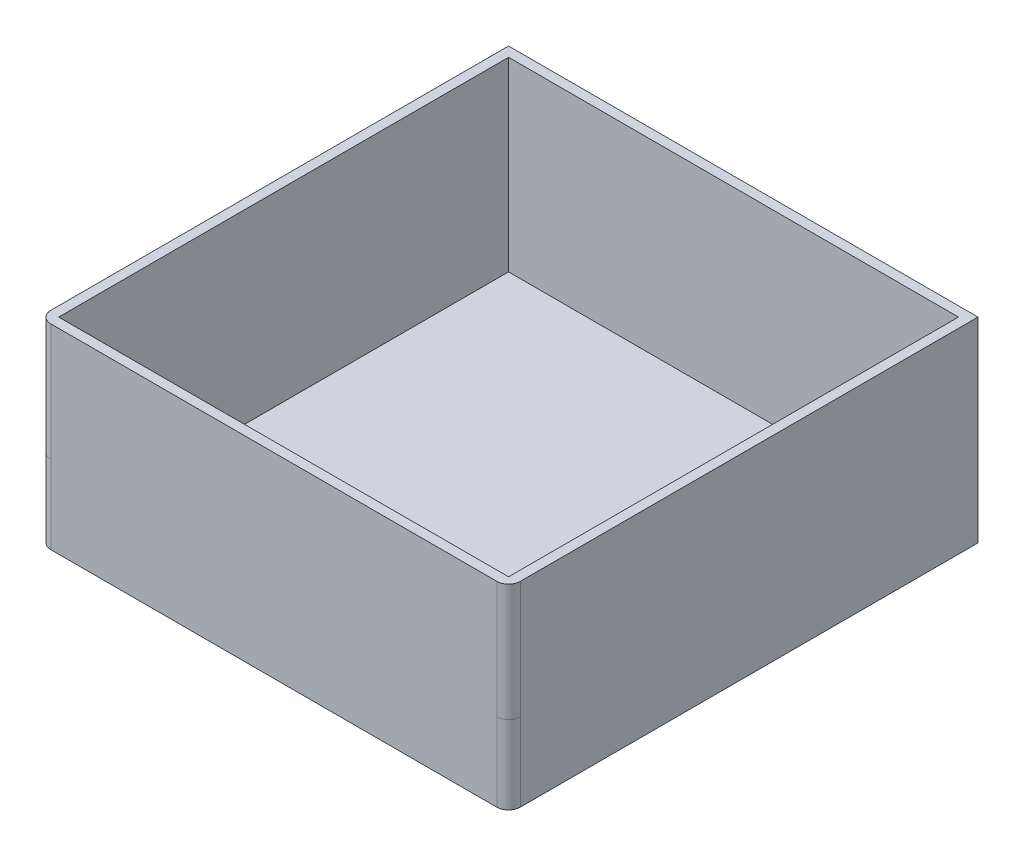
ISO-10303-21;
HEADER;
FILE_DESCRIPTION(('STEP AP214'),'2;1');
FILE_NAME('part.step','',(''),(''),'','','');
FILE_SCHEMA(('AUTOMOTIVE_DESIGN { 1 0 10303 214 1 1 1 1 }'));
ENDSEC;
DATA;
#1=APPLICATION_CONTEXT('core data for automotive mechanical design processes');
#2=APPLICATION_PROTOCOL_DEFINITION('international standard','automotive_design',2000,#1);
#3=PRODUCT_CONTEXT('',#1,'mechanical');
#4=PRODUCT('Part','Part','',(#3));
#5=PRODUCT_RELATED_PRODUCT_CATEGORY('part','',(#4));
#6=PRODUCT_DEFINITION_FORMATION('','',#4);
#7=PRODUCT_DEFINITION_CONTEXT('part definition',#1,'design');
#8=PRODUCT_DEFINITION('design','',#6,#7);
#9=PRODUCT_DEFINITION_SHAPE('','',#8);
#10=(LENGTH_UNIT() NAMED_UNIT(*) SI_UNIT(.MILLI.,.METRE.));
#11=(NAMED_UNIT(*) PLANE_ANGLE_UNIT() SI_UNIT($,.RADIAN.));
#12=(NAMED_UNIT(*) SI_UNIT($,.STERADIAN.) SOLID_ANGLE_UNIT());
#13=UNCERTAINTY_MEASURE_WITH_UNIT(LENGTH_MEASURE(1.E-05),#10,'distance_accuracy_value','');
#14=(GEOMETRIC_REPRESENTATION_CONTEXT(3) GLOBAL_UNCERTAINTY_ASSIGNED_CONTEXT((#13)) GLOBAL_UNIT_ASSIGNED_CONTEXT((#10,
#11,#12)) REPRESENTATION_CONTEXT('',''));
#15=CARTESIAN_POINT('',(0.,0.,0.));
#16=DIRECTION('',(0.,0.,1.));
#17=DIRECTION('',(1.,0.,0.));
#18=AXIS2_PLACEMENT_3D('',#15,#16,#17);
#19=CARTESIAN_POINT('',(0.,2.5,-2.5));
#20=DIRECTION('',(0.,0.,-1.));
#21=DIRECTION('',(-1.,0.,0.));
#22=AXIS2_PLACEMENT_3D('',#19,#20,#21);
#23=PLANE('',#22);
#24=DIRECTION('',(0.,1.,0.));
#25=VECTOR('',#24,1.);
#26=CARTESIAN_POINT('',(2.49999999999999,2.5,-2.5));
#27=LINE('',#26,#25);
#28=CARTESIAN_POINT('',(2.49999999999999,2.5,-2.5));
#29=VERTEX_POINT('',#28);
#30=CARTESIAN_POINT('',(2.49999999999999,50.,-2.5));
#31=VERTEX_POINT('',#30);
#32=EDGE_CURVE('E128',#29,#31,#27,.T.);
#33=ORIENTED_EDGE('',*,*,#32,.T.);
#34=DIRECTION('',(1.,0.,0.));
#35=VECTOR('',#34,1.);
#36=CARTESIAN_POINT('',(2.49999999999999,50.,-2.5));
#37=LINE('',#36,#35);
#38=CARTESIAN_POINT('',(117.5,50.,-2.5));
#39=VERTEX_POINT('',#38);
#40=EDGE_CURVE('E132',#31,#39,#37,.T.);
#41=ORIENTED_EDGE('',*,*,#40,.T.);
#42=DIRECTION('',(0.,1.,0.));
#43=VECTOR('',#42,1.);
#44=CARTESIAN_POINT('',(117.5,2.5,-2.5));
#45=LINE('',#44,#43);
#46=CARTESIAN_POINT('',(117.5,2.5,-2.5));
#47=VERTEX_POINT('',#46);
#48=EDGE_CURVE('E171',#47,#39,#45,.T.);
#49=ORIENTED_EDGE('',*,*,#48,.F.);
#50=DIRECTION('',(-1.,0.,0.));
#51=VECTOR('',#50,1.);
#52=CARTESIAN_POINT('',(0.,2.5,-2.5));
#53=LINE('',#52,#51);
#54=EDGE_CURVE('E135',#47,#29,#53,.T.);
#55=ORIENTED_EDGE('',*,*,#54,.T.);
#56=EDGE_LOOP('',(#33,#41,#49,#55));
#57=FACE_BOUND('',#56,.T.);
#58=ADVANCED_FACE('F35',(#57),#23,.T.);
#59=CARTESIAN_POINT('',(2.49999999999999,2.5,0.));
#60=DIRECTION('',(1.,0.,0.));
#61=DIRECTION('',(0.,0.,-1.));
#62=AXIS2_PLACEMENT_3D('',#59,#60,#61);
#63=PLANE('',#62);
#64=DIRECTION('',(0.,1.,0.));
#65=VECTOR('',#64,1.);
#66=CARTESIAN_POINT('',(2.49999999999999,2.5,-117.5));
#67=LINE('',#66,#65);
#68=CARTESIAN_POINT('',(2.49999999999999,2.5,-117.5));
#69=VERTEX_POINT('',#68);
#70=CARTESIAN_POINT('',(2.49999999999999,50.,-117.5));
#71=VERTEX_POINT('',#70);
#72=EDGE_CURVE('E138',#69,#71,#67,.T.);
#73=ORIENTED_EDGE('',*,*,#72,.T.);
#74=DIRECTION('',(0.,0.,1.));
#75=VECTOR('',#74,1.);
#76=CARTESIAN_POINT('',(2.49999999999999,50.,-117.5));
#77=LINE('',#76,#75);
#78=EDGE_CURVE('E141',#71,#31,#77,.T.);
#79=ORIENTED_EDGE('',*,*,#78,.T.);
#80=ORIENTED_EDGE('',*,*,#32,.F.);
#81=DIRECTION('',(0.,0.,-1.));
#82=VECTOR('',#81,1.);
#83=CARTESIAN_POINT('',(2.49999999999999,2.5,0.));
#84=LINE('',#83,#82);
#85=EDGE_CURVE('E170',#29,#69,#84,.T.);
#86=ORIENTED_EDGE('',*,*,#85,.T.);
#87=EDGE_LOOP('',(#73,#79,#80,#86));
#88=FACE_BOUND('',#87,.T.);
#89=ADVANCED_FACE('F142',(#88),#63,.T.);
#90=CARTESIAN_POINT('',(0.,2.5,-117.5));
#91=DIRECTION('',(0.,0.,1.));
#92=DIRECTION('',(1.,0.,0.));
#93=AXIS2_PLACEMENT_3D('',#90,#91,#92);
#94=PLANE('',#93);
#95=DIRECTION('',(0.,1.,0.));
#96=VECTOR('',#95,1.);
#97=CARTESIAN_POINT('',(117.5,2.5,-117.5));
#98=LINE('',#97,#96);
#99=CARTESIAN_POINT('',(117.5,2.5,-117.5));
#100=VERTEX_POINT('',#99);
#101=CARTESIAN_POINT('',(117.5,50.,-117.5));
#102=VERTEX_POINT('',#101);
#103=EDGE_CURVE('E174',#100,#102,#98,.T.);
#104=ORIENTED_EDGE('',*,*,#103,.T.);
#105=DIRECTION('',(-1.,0.,0.));
#106=VECTOR('',#105,1.);
#107=CARTESIAN_POINT('',(2.49999999999999,50.,-117.5));
#108=LINE('',#107,#106);
#109=EDGE_CURVE('E152',#102,#71,#108,.T.);
#110=ORIENTED_EDGE('',*,*,#109,.T.);
#111=ORIENTED_EDGE('',*,*,#72,.F.);
#112=DIRECTION('',(1.,0.,0.));
#113=VECTOR('',#112,1.);
#114=CARTESIAN_POINT('',(0.,2.5,-117.5));
#115=LINE('',#114,#113);
#116=EDGE_CURVE('E168',#69,#100,#115,.T.);
#117=ORIENTED_EDGE('',*,*,#116,.T.);
#118=EDGE_LOOP('',(#104,#110,#111,#117));
#119=FACE_BOUND('',#118,.T.);
#120=ADVANCED_FACE('F278',(#119),#94,.T.);
#121=CARTESIAN_POINT('',(117.5,2.5,0.));
#122=DIRECTION('',(-1.,0.,0.));
#123=DIRECTION('',(0.,0.,1.));
#124=AXIS2_PLACEMENT_3D('',#121,#122,#123);
#125=PLANE('',#124);
#126=ORIENTED_EDGE('',*,*,#48,.T.);
#127=DIRECTION('',(0.,0.,-1.));
#128=VECTOR('',#127,1.);
#129=CARTESIAN_POINT('',(117.5,50.,-117.5));
#130=LINE('',#129,#128);
#131=EDGE_CURVE('E150',#39,#102,#130,.T.);
#132=ORIENTED_EDGE('',*,*,#131,.T.);
#133=ORIENTED_EDGE('',*,*,#103,.F.);
#134=DIRECTION('',(0.,0.,1.));
#135=VECTOR('',#134,1.);
#136=CARTESIAN_POINT('',(117.5,2.5,0.));
#137=LINE('',#136,#135);
#138=EDGE_CURVE('E166',#100,#47,#137,.T.);
#139=ORIENTED_EDGE('',*,*,#138,.T.);
#140=EDGE_LOOP('',(#126,#132,#133,#139));
#141=FACE_BOUND('',#140,.T.);
#142=ADVANCED_FACE('F282',(#141),#125,.T.);
#143=CARTESIAN_POINT('',(0.,2.5,0.));
#144=DIRECTION('',(0.,1.,0.));
#145=DIRECTION('',(0.,0.,1.));
#146=AXIS2_PLACEMENT_3D('',#143,#144,#145);
#147=PLANE('',#146);
#148=ORIENTED_EDGE('',*,*,#54,.F.);
#149=ORIENTED_EDGE('',*,*,#138,.F.);
#150=ORIENTED_EDGE('',*,*,#116,.F.);
#151=ORIENTED_EDGE('',*,*,#85,.F.);
#152=EDGE_LOOP('',(#148,#149,#150,#151));
#153=FACE_BOUND('',#152,.T.);
#154=ADVANCED_FACE('F389',(#153),#147,.T.);
#155=CARTESIAN_POINT('',(0.,50.,0.));
#156=DIRECTION('',(0.,1.,0.));
#157=DIRECTION('',(0.,0.,1.));
#158=AXIS2_PLACEMENT_3D('',#155,#156,#157);
#159=PLANE('',#158);
#160=DIRECTION('',(1.,0.,0.));
#161=VECTOR('',#160,1.);
#162=CARTESIAN_POINT('',(0.,50.,0.));
#163=LINE('',#162,#161);
#164=CARTESIAN_POINT('',(3.,50.,0.));
#165=VERTEX_POINT('',#164);
#166=CARTESIAN_POINT('',(117.,50.,0.));
#167=VERTEX_POINT('',#166);
#168=EDGE_CURVE('E158',#165,#167,#163,.T.);
#169=ORIENTED_EDGE('',*,*,#168,.T.);
#170=CARTESIAN_POINT('',(117.,50.,-3.));
#171=DIRECTION('',(0.,1.,0.));
#172=DIRECTION('',(0.,0.,1.));
#173=AXIS2_PLACEMENT_3D('',#170,#171,#172);
#174=CIRCLE('',#173,3.);
#175=CARTESIAN_POINT('',(120.,50.,-3.));
#176=VERTEX_POINT('',#175);
#177=EDGE_CURVE('E44',#167,#176,#174,.T.);
#178=ORIENTED_EDGE('',*,*,#177,.T.);
#179=DIRECTION('',(0.,0.,-1.));
#180=VECTOR('',#179,1.);
#181=CARTESIAN_POINT('',(120.,50.,-120.));
#182=LINE('',#181,#180);
#183=CARTESIAN_POINT('',(120.,50.,-120.));
#184=VERTEX_POINT('',#183);
#185=EDGE_CURVE('E160',#176,#184,#182,.T.);
#186=ORIENTED_EDGE('',*,*,#185,.T.);
#187=DIRECTION('',(-1.,0.,0.));
#188=VECTOR('',#187,1.);
#189=CARTESIAN_POINT('',(0.,50.,-120.));
#190=LINE('',#189,#188);
#191=CARTESIAN_POINT('',(0.,50.,-120.));
#192=VERTEX_POINT('',#191);
#193=EDGE_CURVE('E162',#184,#192,#190,.T.);
#194=ORIENTED_EDGE('',*,*,#193,.T.);
#195=DIRECTION('',(0.,0.,1.));
#196=VECTOR('',#195,1.);
#197=CARTESIAN_POINT('',(0.,50.,-120.));
#198=LINE('',#197,#196);
#199=CARTESIAN_POINT('',(0.,50.,-3.));
#200=VERTEX_POINT('',#199);
#201=EDGE_CURVE('E156',#192,#200,#198,.T.);
#202=ORIENTED_EDGE('',*,*,#201,.T.);
#203=CARTESIAN_POINT('',(3.,50.,-3.));
#204=DIRECTION('',(0.,1.,0.));
#205=DIRECTION('',(0.,0.,1.));
#206=AXIS2_PLACEMENT_3D('',#203,#204,#205);
#207=CIRCLE('',#206,3.);
#208=EDGE_CURVE('E229',#200,#165,#207,.T.);
#209=ORIENTED_EDGE('',*,*,#208,.T.);
#210=EDGE_LOOP('',(#169,#178,#186,#194,#202,#209));
#211=FACE_BOUND('',#210,.T.);
#212=ORIENTED_EDGE('',*,*,#40,.F.);
#213=ORIENTED_EDGE('',*,*,#78,.F.);
#214=ORIENTED_EDGE('',*,*,#109,.F.);
#215=ORIENTED_EDGE('',*,*,#131,.F.);
#216=EDGE_LOOP('',(#212,#213,#214,#215));
#217=FACE_BOUND('',#216,.T.);
#218=ADVANCED_FACE('F148',(#211,#217),#159,.T.);
#219=CARTESIAN_POINT('',(120.,0.,0.));
#220=DIRECTION('',(0.,1.,0.));
#221=DIRECTION('',(0.,0.,1.));
#222=AXIS2_PLACEMENT_3D('',#219,#220,#221);
#223=PLANE('',#222);
#224=DIRECTION('',(-1.,0.,0.));
#225=VECTOR('',#224,1.);
#226=CARTESIAN_POINT('',(120.,0.,0.));
#227=LINE('',#226,#225);
#228=CARTESIAN_POINT('',(117.,0.,0.));
#229=VERTEX_POINT('',#228);
#230=CARTESIAN_POINT('',(3.,0.,0.));
#231=VERTEX_POINT('',#230);
#232=EDGE_CURVE('E189',#229,#231,#227,.T.);
#233=ORIENTED_EDGE('',*,*,#232,.T.);
#234=CARTESIAN_POINT('',(3.,0.,-3.));
#235=DIRECTION('',(0.,1.,0.));
#236=DIRECTION('',(0.,0.,1.));
#237=AXIS2_PLACEMENT_3D('',#234,#235,#236);
#238=CIRCLE('',#237,3.);
#239=CARTESIAN_POINT('',(0.,0.,-3.));
#240=VERTEX_POINT('',#239);
#241=EDGE_CURVE('E254',#231,#240,#238,.F.);
#242=ORIENTED_EDGE('',*,*,#241,.T.);
#243=DIRECTION('',(0.,0.,-1.));
#244=VECTOR('',#243,1.);
#245=CARTESIAN_POINT('',(0.,0.,0.));
#246=LINE('',#245,#244);
#247=CARTESIAN_POINT('',(0.,0.,-120.));
#248=VERTEX_POINT('',#247);
#249=EDGE_CURVE('E137',#240,#248,#246,.T.);
#250=ORIENTED_EDGE('',*,*,#249,.T.);
#251=DIRECTION('',(-1.,0.,0.));
#252=VECTOR('',#251,1.);
#253=CARTESIAN_POINT('',(120.,0.,-120.));
#254=LINE('',#253,#252);
#255=CARTESIAN_POINT('',(120.,0.,-120.));
#256=VERTEX_POINT('',#255);
#257=EDGE_CURVE('E183',#256,#248,#254,.T.);
#258=ORIENTED_EDGE('',*,*,#257,.F.);
#259=DIRECTION('',(0.,0.,-1.));
#260=VECTOR('',#259,1.);
#261=CARTESIAN_POINT('',(120.,0.,0.));
#262=LINE('',#261,#260);
#263=CARTESIAN_POINT('',(120.,0.,-3.));
#264=VERTEX_POINT('',#263);
#265=EDGE_CURVE('E177',#264,#256,#262,.T.);
#266=ORIENTED_EDGE('',*,*,#265,.F.);
#267=CARTESIAN_POINT('',(117.,0.,-3.));
#268=DIRECTION('',(0.,1.,0.));
#269=DIRECTION('',(0.,0.,1.));
#270=AXIS2_PLACEMENT_3D('',#267,#268,#269);
#271=CIRCLE('',#270,3.);
#272=EDGE_CURVE('E211',#264,#229,#271,.F.);
#273=ORIENTED_EDGE('',*,*,#272,.T.);
#274=EDGE_LOOP('',(#233,#242,#250,#258,#266,#273));
#275=FACE_BOUND('',#274,.T.);
#276=ADVANCED_FACE('F253',(#275),#223,.F.);
#277=CARTESIAN_POINT('',(120.,0.,-120.));
#278=DIRECTION('',(0.,0.,-1.));
#279=DIRECTION('',(-1.,0.,0.));
#280=AXIS2_PLACEMENT_3D('',#277,#278,#279);
#281=PLANE('',#280);
#282=DIRECTION('',(0.,-1.,0.));
#283=VECTOR('',#282,1.);
#284=CARTESIAN_POINT('',(0.,0.,-120.));
#285=LINE('',#284,#283);
#286=EDGE_CURVE('E180',#192,#248,#285,.T.);
#287=ORIENTED_EDGE('',*,*,#286,.F.);
#288=ORIENTED_EDGE('',*,*,#193,.F.);
#289=DIRECTION('',(0.,-1.,0.));
#290=VECTOR('',#289,1.);
#291=CARTESIAN_POINT('',(120.,0.,-120.));
#292=LINE('',#291,#290);
#293=EDGE_CURVE('E179',#184,#256,#292,.T.);
#294=ORIENTED_EDGE('',*,*,#293,.T.);
#295=ORIENTED_EDGE('',*,*,#257,.T.);
#296=EDGE_LOOP('',(#287,#288,#294,#295));
#297=FACE_BOUND('',#296,.T.);
#298=ADVANCED_FACE('F263',(#297),#281,.T.);
#299=CARTESIAN_POINT('',(117.,0.,-3.));
#300=DIRECTION('',(0.,1.,0.));
#301=DIRECTION('',(0.,0.,1.));
#302=AXIS2_PLACEMENT_3D('',#299,#300,#301);
#303=CYLINDRICAL_SURFACE('',#302,3.);
#304=ORIENTED_EDGE('',*,*,#272,.F.);
#305=DIRECTION('',(0.,1.,0.));
#306=VECTOR('',#305,1.);
#307=CARTESIAN_POINT('',(120.,0.,-3.));
#308=LINE('',#307,#306);
#309=CARTESIAN_POINT('',(120.,20.,-3.));
#310=VERTEX_POINT('',#309);
#311=EDGE_CURVE('E221',#310,#264,#308,.F.);
#312=ORIENTED_EDGE('',*,*,#311,.F.);
#313=CARTESIAN_POINT('',(117.,20.,-3.));
#314=DIRECTION('',(0.,1.,0.));
#315=DIRECTION('',(0.,0.,1.));
#316=AXIS2_PLACEMENT_3D('',#313,#314,#315);
#317=CIRCLE('',#316,3.);
#318=CARTESIAN_POINT('',(117.,20.,0.));
#319=VERTEX_POINT('',#318);
#320=EDGE_CURVE('E198',#319,#310,#317,.T.);
#321=ORIENTED_EDGE('',*,*,#320,.F.);
#322=DIRECTION('',(0.,1.,0.));
#323=VECTOR('',#322,1.);
#324=CARTESIAN_POINT('',(117.,0.,0.));
#325=LINE('',#324,#323);
#326=EDGE_CURVE('E204',#229,#319,#325,.T.);
#327=ORIENTED_EDGE('',*,*,#326,.F.);
#328=EDGE_LOOP('',(#304,#312,#321,#327));
#329=FACE_BOUND('',#328,.T.);
#330=ADVANCED_FACE('F247',(#329),#303,.T.);
#331=CARTESIAN_POINT('',(120.,0.,0.));
#332=DIRECTION('',(1.,0.,0.));
#333=DIRECTION('',(0.,0.,-1.));
#334=AXIS2_PLACEMENT_3D('',#331,#332,#333);
#335=PLANE('',#334);
#336=ORIENTED_EDGE('',*,*,#185,.F.);
#337=DIRECTION('',(0.,-1.,0.));
#338=VECTOR('',#337,1.);
#339=CARTESIAN_POINT('',(120.,0.,-3.));
#340=LINE('',#339,#338);
#341=EDGE_CURVE('E217',#176,#310,#340,.T.);
#342=ORIENTED_EDGE('',*,*,#341,.T.);
#343=ORIENTED_EDGE('',*,*,#311,.T.);
#344=ORIENTED_EDGE('',*,*,#265,.T.);
#345=ORIENTED_EDGE('',*,*,#293,.F.);
#346=EDGE_LOOP('',(#336,#342,#343,#344,#345));
#347=FACE_BOUND('',#346,.T.);
#348=ADVANCED_FACE('F240',(#347),#335,.T.);
#349=CARTESIAN_POINT('',(3.,0.,-3.));
#350=DIRECTION('',(0.,-1.,0.));
#351=DIRECTION('',(0.,0.,-1.));
#352=AXIS2_PLACEMENT_3D('',#349,#350,#351);
#353=CYLINDRICAL_SURFACE('',#352,3.);
#354=ORIENTED_EDGE('',*,*,#241,.F.);
#355=DIRECTION('',(0.,1.,0.));
#356=VECTOR('',#355,1.);
#357=CARTESIAN_POINT('',(3.,0.,0.));
#358=LINE('',#357,#356);
#359=CARTESIAN_POINT('',(3.,20.,0.));
#360=VERTEX_POINT('',#359);
#361=EDGE_CURVE('E206',#360,#231,#358,.F.);
#362=ORIENTED_EDGE('',*,*,#361,.F.);
#363=CARTESIAN_POINT('',(3.,20.,-3.));
#364=DIRECTION('',(0.,1.,0.));
#365=DIRECTION('',(0.,0.,1.));
#366=AXIS2_PLACEMENT_3D('',#363,#364,#365);
#367=CIRCLE('',#366,3.);
#368=CARTESIAN_POINT('',(0.,20.,-3.));
#369=VERTEX_POINT('',#368);
#370=EDGE_CURVE('E201',#369,#360,#367,.T.);
#371=ORIENTED_EDGE('',*,*,#370,.F.);
#372=DIRECTION('',(0.,1.,0.));
#373=VECTOR('',#372,1.);
#374=CARTESIAN_POINT('',(0.,20.,-3.));
#375=LINE('',#374,#373);
#376=EDGE_CURVE('E192',#240,#369,#375,.T.);
#377=ORIENTED_EDGE('',*,*,#376,.F.);
#378=EDGE_LOOP('',(#354,#362,#371,#377));
#379=FACE_BOUND('',#378,.T.);
#380=ADVANCED_FACE('F259',(#379),#353,.T.);
#381=CARTESIAN_POINT('',(120.,0.,0.));
#382=DIRECTION('',(0.,0.,1.));
#383=DIRECTION('',(1.,0.,0.));
#384=AXIS2_PLACEMENT_3D('',#381,#382,#383);
#385=PLANE('',#384);
#386=ORIENTED_EDGE('',*,*,#326,.T.);
#387=DIRECTION('',(0.,-1.,0.));
#388=VECTOR('',#387,1.);
#389=CARTESIAN_POINT('',(117.,0.,0.));
#390=LINE('',#389,#388);
#391=EDGE_CURVE('E57',#319,#167,#390,.F.);
#392=ORIENTED_EDGE('',*,*,#391,.T.);
#393=ORIENTED_EDGE('',*,*,#168,.F.);
#394=DIRECTION('',(0.,-1.,0.));
#395=VECTOR('',#394,1.);
#396=CARTESIAN_POINT('',(3.,20.,0.));
#397=LINE('',#396,#395);
#398=EDGE_CURVE('E220',#165,#360,#397,.T.);
#399=ORIENTED_EDGE('',*,*,#398,.T.);
#400=ORIENTED_EDGE('',*,*,#361,.T.);
#401=ORIENTED_EDGE('',*,*,#232,.F.);
#402=EDGE_LOOP('',(#386,#392,#393,#399,#400,#401));
#403=FACE_BOUND('',#402,.T.);
#404=ADVANCED_FACE('F249',(#403),#385,.T.);
#405=CARTESIAN_POINT('',(0.,0.,0.));
#406=DIRECTION('',(1.,0.,0.));
#407=DIRECTION('',(0.,0.,-1.));
#408=AXIS2_PLACEMENT_3D('',#405,#406,#407);
#409=PLANE('',#408);
#410=ORIENTED_EDGE('',*,*,#376,.T.);
#411=DIRECTION('',(0.,-1.,0.));
#412=VECTOR('',#411,1.);
#413=CARTESIAN_POINT('',(0.,50.,-3.));
#414=LINE('',#413,#412);
#415=EDGE_CURVE('E11',#369,#200,#414,.F.);
#416=ORIENTED_EDGE('',*,*,#415,.T.);
#417=ORIENTED_EDGE('',*,*,#201,.F.);
#418=ORIENTED_EDGE('',*,*,#286,.T.);
#419=ORIENTED_EDGE('',*,*,#249,.F.);
#420=EDGE_LOOP('',(#410,#416,#417,#418,#419));
#421=FACE_BOUND('',#420,.T.);
#422=ADVANCED_FACE('F265',(#421),#409,.F.);
#423=CARTESIAN_POINT('',(117.,0.,-3.));
#424=DIRECTION('',(0.,-1.,0.));
#425=DIRECTION('',(0.,0.,-1.));
#426=AXIS2_PLACEMENT_3D('',#423,#424,#425);
#427=CYLINDRICAL_SURFACE('',#426,3.);
#428=ORIENTED_EDGE('',*,*,#177,.F.);
#429=ORIENTED_EDGE('',*,*,#391,.F.);
#430=ORIENTED_EDGE('',*,*,#320,.T.);
#431=ORIENTED_EDGE('',*,*,#341,.F.);
#432=EDGE_LOOP('',(#428,#429,#430,#431));
#433=FACE_BOUND('',#432,.T.);
#434=ADVANCED_FACE('F243',(#433),#427,.T.);
#435=CARTESIAN_POINT('',(3.,0.,-3.));
#436=DIRECTION('',(0.,1.,0.));
#437=DIRECTION('',(0.,0.,1.));
#438=AXIS2_PLACEMENT_3D('',#435,#436,#437);
#439=CYLINDRICAL_SURFACE('',#438,3.);
#440=ORIENTED_EDGE('',*,*,#208,.F.);
#441=ORIENTED_EDGE('',*,*,#415,.F.);
#442=ORIENTED_EDGE('',*,*,#370,.T.);
#443=ORIENTED_EDGE('',*,*,#398,.F.);
#444=EDGE_LOOP('',(#440,#441,#442,#443));
#445=FACE_BOUND('',#444,.T.);
#446=ADVANCED_FACE('F37',(#445),#439,.T.);
#447=CLOSED_SHELL('',(#58,#89,#120,#142,#154,#218,#276,#298,#330,#348,#380,#404,#422,#434,#446));
#448=MANIFOLD_SOLID_BREP('B2',#447);
#449=ADVANCED_BREP_SHAPE_REPRESENTATION('',(#18,#448),#14);
#450=SHAPE_DEFINITION_REPRESENTATION(#9,#449);
ENDSEC;
END-ISO-10303-21;
